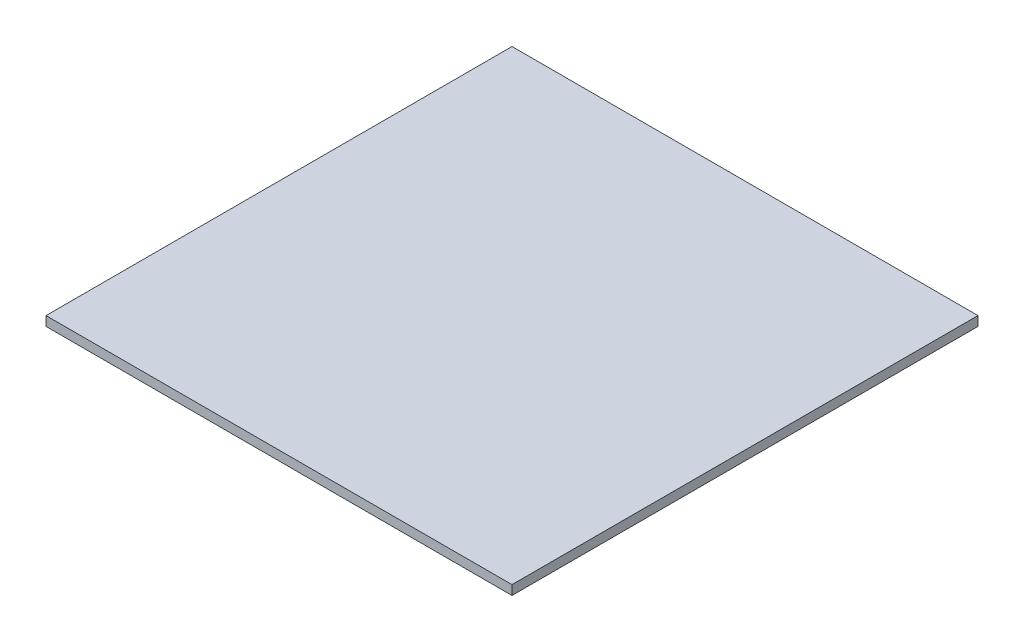
ISO-10303-21;
HEADER;
FILE_DESCRIPTION(('STEP AP214'),'2;1');
FILE_NAME('part.step','',(''),(''),'','','');
FILE_SCHEMA(('AUTOMOTIVE_DESIGN { 1 0 10303 214 1 1 1 1 }'));
ENDSEC;
DATA;
#1=APPLICATION_CONTEXT('core data for automotive mechanical design processes');
#2=APPLICATION_PROTOCOL_DEFINITION('international standard','automotive_design',2000,#1);
#3=PRODUCT_CONTEXT('',#1,'mechanical');
#4=PRODUCT('Part','Part','',(#3));
#5=PRODUCT_RELATED_PRODUCT_CATEGORY('part','',(#4));
#6=PRODUCT_DEFINITION_FORMATION('','',#4);
#7=PRODUCT_DEFINITION_CONTEXT('part definition',#1,'design');
#8=PRODUCT_DEFINITION('design','',#6,#7);
#9=PRODUCT_DEFINITION_SHAPE('','',#8);
#10=(LENGTH_UNIT() NAMED_UNIT(*) SI_UNIT(.MILLI.,.METRE.));
#11=(NAMED_UNIT(*) PLANE_ANGLE_UNIT() SI_UNIT($,.RADIAN.));
#12=(NAMED_UNIT(*) SI_UNIT($,.STERADIAN.) SOLID_ANGLE_UNIT());
#13=UNCERTAINTY_MEASURE_WITH_UNIT(LENGTH_MEASURE(1.E-05),#10,'distance_accuracy_value','');
#14=(GEOMETRIC_REPRESENTATION_CONTEXT(3) GLOBAL_UNCERTAINTY_ASSIGNED_CONTEXT((#13)) GLOBAL_UNIT_ASSIGNED_CONTEXT((#10,
#11,#12)) REPRESENTATION_CONTEXT('',''));
#15=CARTESIAN_POINT('',(0.,0.,0.));
#16=DIRECTION('',(0.,0.,1.));
#17=DIRECTION('',(1.,0.,0.));
#18=AXIS2_PLACEMENT_3D('',#15,#16,#17);
#19=CARTESIAN_POINT('',(104.549818806238,715.200000000011,-495.396752623344));
#20=DIRECTION('',(1.,0.,0.));
#21=DIRECTION('',(0.,0.,-1.));
#22=AXIS2_PLACEMENT_3D('',#19,#20,#21);
#23=PLANE('',#22);
#24=DIRECTION('',(0.,0.,1.));
#25=VECTOR('',#24,1.);
#26=CARTESIAN_POINT('',(104.549818806238,695.200000000011,-495.396752623344));
#27=LINE('',#26,#25);
#28=CARTESIAN_POINT('',(104.549818806238,695.200000000011,-495.396752623344));
#29=VERTEX_POINT('',#28);
#30=CARTESIAN_POINT('',(104.549818806238,695.200000000011,494.603247376656));
#31=VERTEX_POINT('',#30);
#32=EDGE_CURVE('E113',#29,#31,#27,.T.);
#33=ORIENTED_EDGE('',*,*,#32,.T.);
#34=DIRECTION('',(0.,-1.,0.));
#35=VECTOR('',#34,1.);
#36=CARTESIAN_POINT('',(104.549818806238,715.200000000011,494.603247376656));
#37=LINE('',#36,#35);
#38=CARTESIAN_POINT('',(104.549818806238,715.200000000011,494.603247376656));
#39=VERTEX_POINT('',#38);
#40=EDGE_CURVE('E11',#39,#31,#37,.T.);
#41=ORIENTED_EDGE('',*,*,#40,.F.);
#42=DIRECTION('',(0.,0.,1.));
#43=VECTOR('',#42,1.);
#44=CARTESIAN_POINT('',(104.549818806238,715.200000000011,-495.396752623344));
#45=LINE('',#44,#43);
#46=CARTESIAN_POINT('',(104.549818806238,715.200000000011,-495.396752623344));
#47=VERTEX_POINT('',#46);
#48=EDGE_CURVE('E97',#47,#39,#45,.T.);
#49=ORIENTED_EDGE('',*,*,#48,.F.);
#50=DIRECTION('',(0.,-1.,0.));
#51=VECTOR('',#50,1.);
#52=CARTESIAN_POINT('',(104.549818806238,715.200000000011,-495.396752623344));
#53=LINE('',#52,#51);
#54=EDGE_CURVE('E109',#47,#29,#53,.T.);
#55=ORIENTED_EDGE('',*,*,#54,.T.);
#56=EDGE_LOOP('',(#33,#41,#49,#55));
#57=FACE_BOUND('',#56,.T.);
#58=ADVANCED_FACE('F45',(#57),#23,.F.);
#59=CARTESIAN_POINT('',(104.549818806238,715.200000000011,494.603247376656));
#60=DIRECTION('',(0.,0.,-1.));
#61=DIRECTION('',(-1.,0.,0.));
#62=AXIS2_PLACEMENT_3D('',#59,#60,#61);
#63=PLANE('',#62);
#64=DIRECTION('',(1.,0.,0.));
#65=VECTOR('',#64,1.);
#66=CARTESIAN_POINT('',(104.549818806238,695.200000000011,494.603247376656));
#67=LINE('',#66,#65);
#68=CARTESIAN_POINT('',(1094.49321386162,695.200000000011,494.603247376656));
#69=VERTEX_POINT('',#68);
#70=EDGE_CURVE('E102',#31,#69,#67,.T.);
#71=ORIENTED_EDGE('',*,*,#70,.T.);
#72=DIRECTION('',(0.,-1.,0.));
#73=VECTOR('',#72,1.);
#74=CARTESIAN_POINT('',(1094.49321386162,715.200000000011,494.603247376656));
#75=LINE('',#74,#73);
#76=CARTESIAN_POINT('',(1094.49321386162,715.200000000011,494.603247376656));
#77=VERTEX_POINT('',#76);
#78=EDGE_CURVE('E54',#77,#69,#75,.T.);
#79=ORIENTED_EDGE('',*,*,#78,.F.);
#80=DIRECTION('',(1.,0.,0.));
#81=VECTOR('',#80,1.);
#82=CARTESIAN_POINT('',(104.549818806238,715.200000000011,494.603247376656));
#83=LINE('',#82,#81);
#84=EDGE_CURVE('E92',#39,#77,#83,.T.);
#85=ORIENTED_EDGE('',*,*,#84,.F.);
#86=ORIENTED_EDGE('',*,*,#40,.T.);
#87=EDGE_LOOP('',(#71,#79,#85,#86));
#88=FACE_BOUND('',#87,.T.);
#89=ADVANCED_FACE('F101',(#88),#63,.F.);
#90=CARTESIAN_POINT('',(1094.49321386162,715.200000000011,-495.396752623344));
#91=DIRECTION('',(-1.,0.,0.));
#92=DIRECTION('',(0.,0.,1.));
#93=AXIS2_PLACEMENT_3D('',#90,#91,#92);
#94=PLANE('',#93);
#95=DIRECTION('',(0.,0.,-1.));
#96=VECTOR('',#95,1.);
#97=CARTESIAN_POINT('',(1094.49321386162,695.200000000011,-495.396752623344));
#98=LINE('',#97,#96);
#99=CARTESIAN_POINT('',(1094.49321386162,695.200000000011,-495.396752623344));
#100=VERTEX_POINT('',#99);
#101=EDGE_CURVE('E79',#69,#100,#98,.T.);
#102=ORIENTED_EDGE('',*,*,#101,.T.);
#103=DIRECTION('',(0.,-1.,0.));
#104=VECTOR('',#103,1.);
#105=CARTESIAN_POINT('',(1094.49321386162,715.200000000011,-495.396752623344));
#106=LINE('',#105,#104);
#107=CARTESIAN_POINT('',(1094.49321386162,715.200000000011,-495.396752623344));
#108=VERTEX_POINT('',#107);
#109=EDGE_CURVE('E104',#108,#100,#106,.T.);
#110=ORIENTED_EDGE('',*,*,#109,.F.);
#111=DIRECTION('',(0.,0.,-1.));
#112=VECTOR('',#111,1.);
#113=CARTESIAN_POINT('',(1094.49321386162,715.200000000011,-495.396752623344));
#114=LINE('',#113,#112);
#115=EDGE_CURVE('E95',#77,#108,#114,.T.);
#116=ORIENTED_EDGE('',*,*,#115,.F.);
#117=ORIENTED_EDGE('',*,*,#78,.T.);
#118=EDGE_LOOP('',(#102,#110,#116,#117));
#119=FACE_BOUND('',#118,.T.);
#120=ADVANCED_FACE('F105',(#119),#94,.F.);
#121=CARTESIAN_POINT('',(104.549818806238,715.200000000011,-495.396752623344));
#122=DIRECTION('',(0.,0.,1.));
#123=DIRECTION('',(1.,0.,0.));
#124=AXIS2_PLACEMENT_3D('',#121,#122,#123);
#125=PLANE('',#124);
#126=DIRECTION('',(-1.,0.,0.));
#127=VECTOR('',#126,1.);
#128=CARTESIAN_POINT('',(104.549818806238,695.200000000011,-495.396752623344));
#129=LINE('',#128,#127);
#130=EDGE_CURVE('E85',#100,#29,#129,.T.);
#131=ORIENTED_EDGE('',*,*,#130,.T.);
#132=ORIENTED_EDGE('',*,*,#54,.F.);
#133=DIRECTION('',(-1.,0.,0.));
#134=VECTOR('',#133,1.);
#135=CARTESIAN_POINT('',(104.549818806238,715.200000000011,-495.396752623344));
#136=LINE('',#135,#134);
#137=EDGE_CURVE('E62',#108,#47,#136,.T.);
#138=ORIENTED_EDGE('',*,*,#137,.F.);
#139=ORIENTED_EDGE('',*,*,#109,.T.);
#140=EDGE_LOOP('',(#131,#132,#138,#139));
#141=FACE_BOUND('',#140,.T.);
#142=ADVANCED_FACE('F126',(#141),#125,.F.);
#143=CARTESIAN_POINT('',(0.,715.200000000011,0.));
#144=DIRECTION('',(0.,1.,0.));
#145=DIRECTION('',(0.,0.,1.));
#146=AXIS2_PLACEMENT_3D('',#143,#144,#145);
#147=PLANE('',#146);
#148=ORIENTED_EDGE('',*,*,#48,.T.);
#149=ORIENTED_EDGE('',*,*,#84,.T.);
#150=ORIENTED_EDGE('',*,*,#115,.T.);
#151=ORIENTED_EDGE('',*,*,#137,.T.);
#152=EDGE_LOOP('',(#148,#149,#150,#151));
#153=FACE_BOUND('',#152,.T.);
#154=ADVANCED_FACE('F93',(#153),#147,.T.);
#155=CARTESIAN_POINT('',(0.,695.200000000011,0.));
#156=DIRECTION('',(0.,1.,0.));
#157=DIRECTION('',(0.,0.,1.));
#158=AXIS2_PLACEMENT_3D('',#155,#156,#157);
#159=PLANE('',#158);
#160=ORIENTED_EDGE('',*,*,#32,.F.);
#161=ORIENTED_EDGE('',*,*,#130,.F.);
#162=ORIENTED_EDGE('',*,*,#101,.F.);
#163=ORIENTED_EDGE('',*,*,#70,.F.);
#164=EDGE_LOOP('',(#160,#161,#162,#163));
#165=FACE_BOUND('',#164,.T.);
#166=ADVANCED_FACE('F129',(#165),#159,.F.);
#167=CLOSED_SHELL('',(#58,#89,#120,#142,#154,#166));
#168=MANIFOLD_SOLID_BREP('B2',#167);
#169=ADVANCED_BREP_SHAPE_REPRESENTATION('',(#18,#168),#14);
#170=SHAPE_DEFINITION_REPRESENTATION(#9,#169);
ENDSEC;
END-ISO-10303-21;
